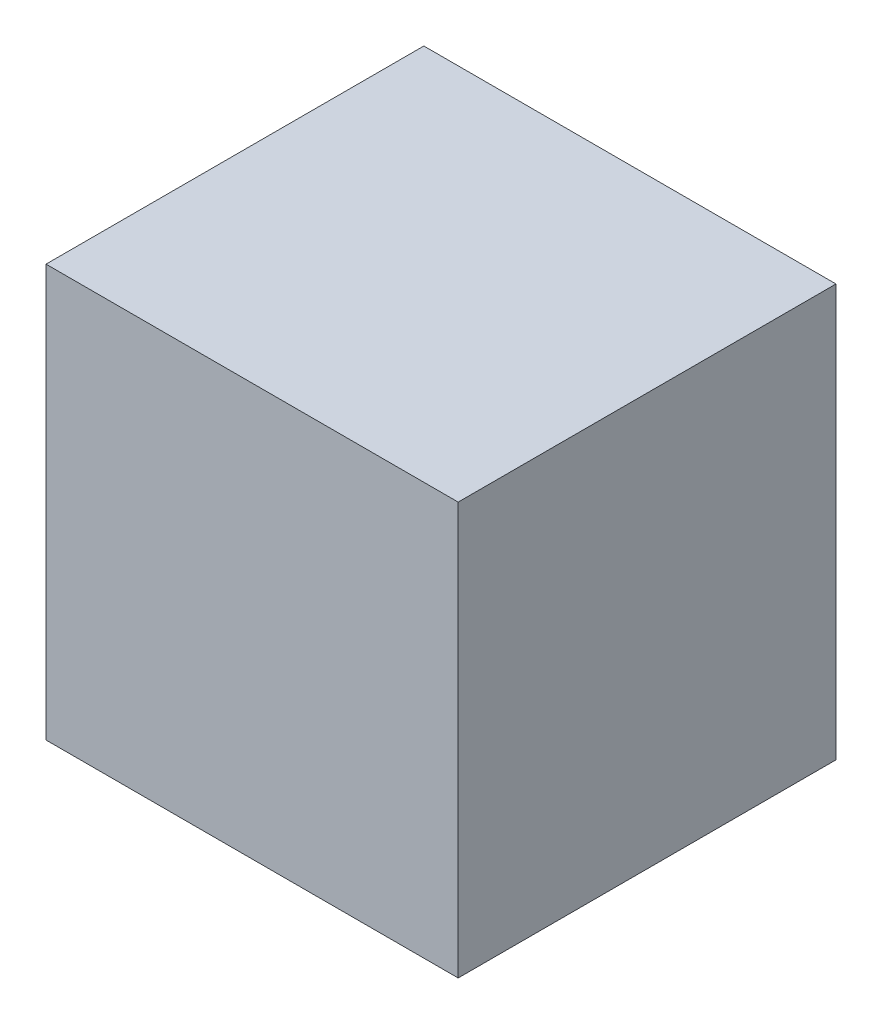
ISO-10303-21;
HEADER;
FILE_DESCRIPTION(('STEP AP214'),'2;1');
FILE_NAME('part.step','',(''),(''),'','','');
FILE_SCHEMA(('AUTOMOTIVE_DESIGN { 1 0 10303 214 1 1 1 1 }'));
ENDSEC;
DATA;
#1=APPLICATION_CONTEXT('core data for automotive mechanical design processes');
#2=APPLICATION_PROTOCOL_DEFINITION('international standard','automotive_design',2000,#1);
#3=PRODUCT_CONTEXT('',#1,'mechanical');
#4=PRODUCT('Part','Part','',(#3));
#5=PRODUCT_RELATED_PRODUCT_CATEGORY('part','',(#4));
#6=PRODUCT_DEFINITION_FORMATION('','',#4);
#7=PRODUCT_DEFINITION_CONTEXT('part definition',#1,'design');
#8=PRODUCT_DEFINITION('design','',#6,#7);
#9=PRODUCT_DEFINITION_SHAPE('','',#8);
#10=(LENGTH_UNIT() NAMED_UNIT(*) SI_UNIT(.MILLI.,.METRE.));
#11=(NAMED_UNIT(*) PLANE_ANGLE_UNIT() SI_UNIT($,.RADIAN.));
#12=(NAMED_UNIT(*) SI_UNIT($,.STERADIAN.) SOLID_ANGLE_UNIT());
#13=UNCERTAINTY_MEASURE_WITH_UNIT(LENGTH_MEASURE(1.E-05),#10,'distance_accuracy_value','');
#14=(GEOMETRIC_REPRESENTATION_CONTEXT(3) GLOBAL_UNCERTAINTY_ASSIGNED_CONTEXT((#13)) GLOBAL_UNIT_ASSIGNED_CONTEXT((#10,
#11,#12)) REPRESENTATION_CONTEXT('',''));
#15=CARTESIAN_POINT('',(0.,0.,0.));
#16=DIRECTION('',(0.,0.,1.));
#17=DIRECTION('',(1.,0.,0.));
#18=AXIS2_PLACEMENT_3D('',#15,#16,#17);
#19=CARTESIAN_POINT('',(600.,-600.,1100.));
#20=DIRECTION('',(-1.,0.,0.));
#21=DIRECTION('',(0.,0.,1.));
#22=AXIS2_PLACEMENT_3D('',#19,#20,#21);
#23=PLANE('',#22);
#24=DIRECTION('',(0.,1.,0.));
#25=VECTOR('',#24,1.);
#26=CARTESIAN_POINT('',(600.,-600.,0.));
#27=LINE('',#26,#25);
#28=CARTESIAN_POINT('',(600.,-600.,0.));
#29=VERTEX_POINT('',#28);
#30=CARTESIAN_POINT('',(600.,600.,0.));
#31=VERTEX_POINT('',#30);
#32=EDGE_CURVE('E98',#29,#31,#27,.T.);
#33=ORIENTED_EDGE('',*,*,#32,.T.);
#34=DIRECTION('',(0.,0.,-1.));
#35=VECTOR('',#34,1.);
#36=CARTESIAN_POINT('',(600.,600.,1100.));
#37=LINE('',#36,#35);
#38=CARTESIAN_POINT('',(600.,600.,1100.));
#39=VERTEX_POINT('',#38);
#40=EDGE_CURVE('E11',#39,#31,#37,.T.);
#41=ORIENTED_EDGE('',*,*,#40,.F.);
#42=DIRECTION('',(0.,1.,0.));
#43=VECTOR('',#42,1.);
#44=CARTESIAN_POINT('',(600.,-600.,1100.));
#45=LINE('',#44,#43);
#46=CARTESIAN_POINT('',(600.,-600.,1100.));
#47=VERTEX_POINT('',#46);
#48=EDGE_CURVE('E86',#47,#39,#45,.T.);
#49=ORIENTED_EDGE('',*,*,#48,.F.);
#50=DIRECTION('',(0.,0.,-1.));
#51=VECTOR('',#50,1.);
#52=CARTESIAN_POINT('',(600.,-600.,1100.));
#53=LINE('',#52,#51);
#54=EDGE_CURVE('E94',#47,#29,#53,.T.);
#55=ORIENTED_EDGE('',*,*,#54,.T.);
#56=EDGE_LOOP('',(#33,#41,#49,#55));
#57=FACE_BOUND('',#56,.T.);
#58=ADVANCED_FACE('F35',(#57),#23,.F.);
#59=CARTESIAN_POINT('',(-600.,600.,1100.));
#60=DIRECTION('',(0.,-1.,0.));
#61=DIRECTION('',(0.,0.,-1.));
#62=AXIS2_PLACEMENT_3D('',#59,#60,#61);
#63=PLANE('',#62);
#64=DIRECTION('',(-1.,0.,0.));
#65=VECTOR('',#64,1.);
#66=CARTESIAN_POINT('',(-600.,600.,0.));
#67=LINE('',#66,#65);
#68=CARTESIAN_POINT('',(-600.,600.,0.));
#69=VERTEX_POINT('',#68);
#70=EDGE_CURVE('E90',#31,#69,#67,.T.);
#71=ORIENTED_EDGE('',*,*,#70,.T.);
#72=DIRECTION('',(0.,0.,-1.));
#73=VECTOR('',#72,1.);
#74=CARTESIAN_POINT('',(-600.,600.,1100.));
#75=LINE('',#74,#73);
#76=CARTESIAN_POINT('',(-600.,600.,1100.));
#77=VERTEX_POINT('',#76);
#78=EDGE_CURVE('E43',#77,#69,#75,.T.);
#79=ORIENTED_EDGE('',*,*,#78,.F.);
#80=DIRECTION('',(-1.,0.,0.));
#81=VECTOR('',#80,1.);
#82=CARTESIAN_POINT('',(-600.,600.,1100.));
#83=LINE('',#82,#81);
#84=EDGE_CURVE('E81',#39,#77,#83,.T.);
#85=ORIENTED_EDGE('',*,*,#84,.F.);
#86=ORIENTED_EDGE('',*,*,#40,.T.);
#87=EDGE_LOOP('',(#71,#79,#85,#86));
#88=FACE_BOUND('',#87,.T.);
#89=ADVANCED_FACE('F89',(#88),#63,.F.);
#90=CARTESIAN_POINT('',(-600.,-600.,1100.));
#91=DIRECTION('',(1.,0.,0.));
#92=DIRECTION('',(0.,0.,-1.));
#93=AXIS2_PLACEMENT_3D('',#90,#91,#92);
#94=PLANE('',#93);
#95=DIRECTION('',(0.,-1.,0.));
#96=VECTOR('',#95,1.);
#97=CARTESIAN_POINT('',(-600.,-600.,0.));
#98=LINE('',#97,#96);
#99=CARTESIAN_POINT('',(-600.,-600.,0.));
#100=VERTEX_POINT('',#99);
#101=EDGE_CURVE('E68',#69,#100,#98,.T.);
#102=ORIENTED_EDGE('',*,*,#101,.T.);
#103=DIRECTION('',(0.,0.,-1.));
#104=VECTOR('',#103,1.);
#105=CARTESIAN_POINT('',(-600.,-600.,1100.));
#106=LINE('',#105,#104);
#107=CARTESIAN_POINT('',(-600.,-600.,1100.));
#108=VERTEX_POINT('',#107);
#109=EDGE_CURVE('E91',#108,#100,#106,.T.);
#110=ORIENTED_EDGE('',*,*,#109,.F.);
#111=DIRECTION('',(0.,-1.,0.));
#112=VECTOR('',#111,1.);
#113=CARTESIAN_POINT('',(-600.,-600.,1100.));
#114=LINE('',#113,#112);
#115=EDGE_CURVE('E84',#77,#108,#114,.T.);
#116=ORIENTED_EDGE('',*,*,#115,.F.);
#117=ORIENTED_EDGE('',*,*,#78,.T.);
#118=EDGE_LOOP('',(#102,#110,#116,#117));
#119=FACE_BOUND('',#118,.T.);
#120=ADVANCED_FACE('F92',(#119),#94,.F.);
#121=CARTESIAN_POINT('',(-600.,-600.,1100.));
#122=DIRECTION('',(0.,1.,0.));
#123=DIRECTION('',(0.,0.,1.));
#124=AXIS2_PLACEMENT_3D('',#121,#122,#123);
#125=PLANE('',#124);
#126=DIRECTION('',(1.,0.,0.));
#127=VECTOR('',#126,1.);
#128=CARTESIAN_POINT('',(-600.,-600.,0.));
#129=LINE('',#128,#127);
#130=EDGE_CURVE('E74',#100,#29,#129,.T.);
#131=ORIENTED_EDGE('',*,*,#130,.T.);
#132=ORIENTED_EDGE('',*,*,#54,.F.);
#133=DIRECTION('',(1.,0.,0.));
#134=VECTOR('',#133,1.);
#135=CARTESIAN_POINT('',(-600.,-600.,1100.));
#136=LINE('',#135,#134);
#137=EDGE_CURVE('E51',#108,#47,#136,.T.);
#138=ORIENTED_EDGE('',*,*,#137,.F.);
#139=ORIENTED_EDGE('',*,*,#109,.T.);
#140=EDGE_LOOP('',(#131,#132,#138,#139));
#141=FACE_BOUND('',#140,.T.);
#142=ADVANCED_FACE('F105',(#141),#125,.F.);
#143=CARTESIAN_POINT('',(0.,0.,1100.));
#144=DIRECTION('',(0.,0.,-1.));
#145=DIRECTION('',(-1.,0.,0.));
#146=AXIS2_PLACEMENT_3D('',#143,#144,#145);
#147=PLANE('',#146);
#148=ORIENTED_EDGE('',*,*,#48,.T.);
#149=ORIENTED_EDGE('',*,*,#84,.T.);
#150=ORIENTED_EDGE('',*,*,#115,.T.);
#151=ORIENTED_EDGE('',*,*,#137,.T.);
#152=EDGE_LOOP('',(#148,#149,#150,#151));
#153=FACE_BOUND('',#152,.T.);
#154=ADVANCED_FACE('F82',(#153),#147,.F.);
#155=CARTESIAN_POINT('',(0.,0.,0.));
#156=DIRECTION('',(0.,0.,-1.));
#157=DIRECTION('',(-1.,0.,0.));
#158=AXIS2_PLACEMENT_3D('',#155,#156,#157);
#159=PLANE('',#158);
#160=ORIENTED_EDGE('',*,*,#32,.F.);
#161=ORIENTED_EDGE('',*,*,#130,.F.);
#162=ORIENTED_EDGE('',*,*,#101,.F.);
#163=ORIENTED_EDGE('',*,*,#70,.F.);
#164=EDGE_LOOP('',(#160,#161,#162,#163));
#165=FACE_BOUND('',#164,.T.);
#166=ADVANCED_FACE('F108',(#165),#159,.T.);
#167=CLOSED_SHELL('',(#58,#89,#120,#142,#154,#166));
#168=MANIFOLD_SOLID_BREP('B2',#167);
#169=ADVANCED_BREP_SHAPE_REPRESENTATION('',(#18,#168),#14);
#170=SHAPE_DEFINITION_REPRESENTATION(#9,#169);
ENDSEC;
END-ISO-10303-21;
